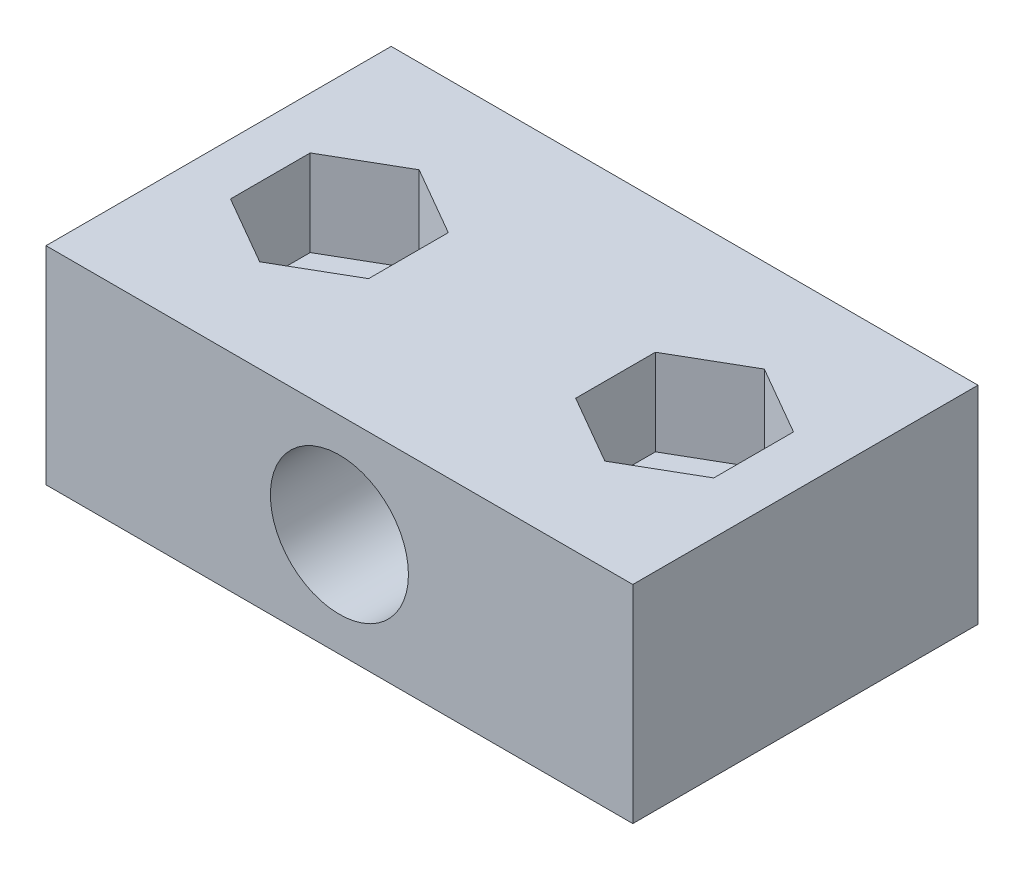
ISO-10303-21;
HEADER;
FILE_DESCRIPTION(('STEP AP214'),'2;1');
FILE_NAME('part.step','',(''),(''),'','','');
FILE_SCHEMA(('AUTOMOTIVE_DESIGN { 1 0 10303 214 1 1 1 1 }'));
ENDSEC;
DATA;
#1=APPLICATION_CONTEXT('core data for automotive mechanical design processes');
#2=APPLICATION_PROTOCOL_DEFINITION('international standard','automotive_design',2000,#1);
#3=PRODUCT_CONTEXT('',#1,'mechanical');
#4=PRODUCT('Part','Part','',(#3));
#5=PRODUCT_RELATED_PRODUCT_CATEGORY('part','',(#4));
#6=PRODUCT_DEFINITION_FORMATION('','',#4);
#7=PRODUCT_DEFINITION_CONTEXT('part definition',#1,'design');
#8=PRODUCT_DEFINITION('design','',#6,#7);
#9=PRODUCT_DEFINITION_SHAPE('','',#8);
#10=(LENGTH_UNIT() NAMED_UNIT(*) SI_UNIT(.MILLI.,.METRE.));
#11=(NAMED_UNIT(*) PLANE_ANGLE_UNIT() SI_UNIT($,.RADIAN.));
#12=(NAMED_UNIT(*) SI_UNIT($,.STERADIAN.) SOLID_ANGLE_UNIT());
#13=UNCERTAINTY_MEASURE_WITH_UNIT(LENGTH_MEASURE(1.E-05),#10,'distance_accuracy_value','');
#14=(GEOMETRIC_REPRESENTATION_CONTEXT(3) GLOBAL_UNCERTAINTY_ASSIGNED_CONTEXT((#13)) GLOBAL_UNIT_ASSIGNED_CONTEXT((#10,
#11,#12)) REPRESENTATION_CONTEXT('',''));
#15=CARTESIAN_POINT('',(0.,0.,0.));
#16=DIRECTION('',(0.,0.,1.));
#17=DIRECTION('',(1.,0.,0.));
#18=AXIS2_PLACEMENT_3D('',#15,#16,#17);
#19=CARTESIAN_POINT('',(-10.,-6.00000000000001,10.));
#20=DIRECTION('',(0.,1.,0.));
#21=DIRECTION('',(-1.,0.,0.));
#22=AXIS2_PLACEMENT_3D('',#19,#20,#21);
#23=CYLINDRICAL_SURFACE('',#22,2.55);
#24=CARTESIAN_POINT('',(-10.,1.,10.));
#25=DIRECTION('',(0.,1.,0.));
#26=DIRECTION('',(0.,0.,1.));
#27=AXIS2_PLACEMENT_3D('',#24,#25,#26);
#28=CIRCLE('',#27,2.55);
#29=CARTESIAN_POINT('',(-10.,1.,12.55));
#30=VERTEX_POINT('',#29);
#31=EDGE_CURVE('E246',#30,#30,#28,.F.);
#32=ORIENTED_EDGE('',*,*,#31,.F.);
#33=EDGE_LOOP('',(#32));
#34=FACE_BOUND('',#33,.T.);
#35=CARTESIAN_POINT('',(-10.,-4.,10.));
#36=DIRECTION('',(0.,-1.,0.));
#37=DIRECTION('',(1.,0.,0.));
#38=AXIS2_PLACEMENT_3D('',#35,#36,#37);
#39=CIRCLE('',#38,2.55);
#40=CARTESIAN_POINT('',(-7.45,-4.,10.));
#41=VERTEX_POINT('',#40);
#42=EDGE_CURVE('E38',#41,#41,#39,.F.);
#43=ORIENTED_EDGE('',*,*,#42,.F.);
#44=EDGE_LOOP('',(#43));
#45=FACE_BOUND('',#44,.T.);
#46=ADVANCED_FACE('F34',(#34,#45),#23,.F.);
#47=CARTESIAN_POINT('',(10.,-6.00000000000001,10.));
#48=DIRECTION('',(0.,1.,0.));
#49=DIRECTION('',(-1.,0.,0.));
#50=AXIS2_PLACEMENT_3D('',#47,#48,#49);
#51=CYLINDRICAL_SURFACE('',#50,2.55);
#52=CARTESIAN_POINT('',(10.,1.,10.));
#53=DIRECTION('',(0.,-1.,0.));
#54=DIRECTION('',(1.,0.,0.));
#55=AXIS2_PLACEMENT_3D('',#52,#53,#54);
#56=CIRCLE('',#55,2.55);
#57=CARTESIAN_POINT('',(12.55,1.00000000000001,10.));
#58=VERTEX_POINT('',#57);
#59=EDGE_CURVE('E201',#58,#58,#56,.F.);
#60=ORIENTED_EDGE('',*,*,#59,.T.);
#61=EDGE_LOOP('',(#60));
#62=FACE_BOUND('',#61,.T.);
#63=CARTESIAN_POINT('',(10.,-4.,10.));
#64=DIRECTION('',(0.,-1.,0.));
#65=DIRECTION('',(1.,0.,0.));
#66=AXIS2_PLACEMENT_3D('',#63,#64,#65);
#67=CIRCLE('',#66,2.55);
#68=CARTESIAN_POINT('',(12.55,-4.,10.));
#69=VERTEX_POINT('',#68);
#70=EDGE_CURVE('E189',#69,#69,#67,.F.);
#71=ORIENTED_EDGE('',*,*,#70,.F.);
#72=EDGE_LOOP('',(#71));
#73=FACE_BOUND('',#72,.T.);
#74=ADVANCED_FACE('F313',(#62,#73),#51,.F.);
#75=CARTESIAN_POINT('',(-17.,-6.,20.));
#76=DIRECTION('',(1.,0.,0.));
#77=DIRECTION('',(0.,0.,-1.));
#78=AXIS2_PLACEMENT_3D('',#75,#76,#77);
#79=PLANE('',#78);
#80=DIRECTION('',(0.,-1.,0.));
#81=VECTOR('',#80,1.);
#82=CARTESIAN_POINT('',(-17.,-6.,0.));
#83=LINE('',#82,#81);
#84=CARTESIAN_POINT('',(-17.,6.,0.));
#85=VERTEX_POINT('',#84);
#86=CARTESIAN_POINT('',(-17.,-6.,0.));
#87=VERTEX_POINT('',#86);
#88=EDGE_CURVE('E259',#85,#87,#83,.T.);
#89=ORIENTED_EDGE('',*,*,#88,.T.);
#90=DIRECTION('',(0.,0.,-1.));
#91=VECTOR('',#90,1.);
#92=CARTESIAN_POINT('',(-17.,-6.,20.));
#93=LINE('',#92,#91);
#94=CARTESIAN_POINT('',(-17.,-6.,20.));
#95=VERTEX_POINT('',#94);
#96=EDGE_CURVE('E11',#95,#87,#93,.T.);
#97=ORIENTED_EDGE('',*,*,#96,.F.);
#98=DIRECTION('',(0.,-1.,0.));
#99=VECTOR('',#98,1.);
#100=CARTESIAN_POINT('',(-17.,-6.,20.));
#101=LINE('',#100,#99);
#102=CARTESIAN_POINT('',(-17.,6.,20.));
#103=VERTEX_POINT('',#102);
#104=EDGE_CURVE('E263',#103,#95,#101,.T.);
#105=ORIENTED_EDGE('',*,*,#104,.F.);
#106=DIRECTION('',(0.,0.,-1.));
#107=VECTOR('',#106,1.);
#108=CARTESIAN_POINT('',(-17.,6.,20.));
#109=LINE('',#108,#107);
#110=EDGE_CURVE('E273',#103,#85,#109,.T.);
#111=ORIENTED_EDGE('',*,*,#110,.T.);
#112=EDGE_LOOP('',(#89,#97,#105,#111));
#113=FACE_BOUND('',#112,.T.);
#114=ADVANCED_FACE('F36',(#113),#79,.F.);
#115=CARTESIAN_POINT('',(17.,-6.,20.));
#116=DIRECTION('',(0.,1.,0.));
#117=DIRECTION('',(-1.,0.,0.));
#118=AXIS2_PLACEMENT_3D('',#115,#116,#117);
#119=PLANE('',#118);
#120=CARTESIAN_POINT('',(-10.,-6.,10.));
#121=DIRECTION('',(0.,-1.,0.));
#122=DIRECTION('',(1.,0.,0.));
#123=AXIS2_PLACEMENT_3D('',#120,#121,#122);
#124=CIRCLE('',#123,4.5);
#125=CARTESIAN_POINT('',(-5.5,-6.,10.));
#126=VERTEX_POINT('',#125);
#127=EDGE_CURVE('E300',#126,#126,#124,.T.);
#128=ORIENTED_EDGE('',*,*,#127,.F.);
#129=EDGE_LOOP('',(#128));
#130=FACE_BOUND('',#129,.T.);
#131=CARTESIAN_POINT('',(10.,-6.,10.));
#132=DIRECTION('',(0.,-1.,0.));
#133=DIRECTION('',(1.,0.,0.));
#134=AXIS2_PLACEMENT_3D('',#131,#132,#133);
#135=CIRCLE('',#134,4.5);
#136=CARTESIAN_POINT('',(14.5,-6.,10.));
#137=VERTEX_POINT('',#136);
#138=EDGE_CURVE('E177',#137,#137,#135,.T.);
#139=ORIENTED_EDGE('',*,*,#138,.F.);
#140=EDGE_LOOP('',(#139));
#141=FACE_BOUND('',#140,.T.);
#142=DIRECTION('',(1.,0.,0.));
#143=VECTOR('',#142,1.);
#144=CARTESIAN_POINT('',(17.,-6.,0.));
#145=LINE('',#144,#143);
#146=CARTESIAN_POINT('',(17.,-6.,0.));
#147=VERTEX_POINT('',#146);
#148=EDGE_CURVE('E276',#87,#147,#145,.T.);
#149=ORIENTED_EDGE('',*,*,#148,.T.);
#150=DIRECTION('',(0.,0.,-1.));
#151=VECTOR('',#150,1.);
#152=CARTESIAN_POINT('',(17.,-6.,20.));
#153=LINE('',#152,#151);
#154=CARTESIAN_POINT('',(17.,-6.,20.));
#155=VERTEX_POINT('',#154);
#156=EDGE_CURVE('E43',#155,#147,#153,.T.);
#157=ORIENTED_EDGE('',*,*,#156,.F.);
#158=DIRECTION('',(1.,0.,0.));
#159=VECTOR('',#158,1.);
#160=CARTESIAN_POINT('',(17.,-6.,20.));
#161=LINE('',#160,#159);
#162=EDGE_CURVE('E266',#95,#155,#161,.T.);
#163=ORIENTED_EDGE('',*,*,#162,.F.);
#164=ORIENTED_EDGE('',*,*,#96,.T.);
#165=EDGE_LOOP('',(#149,#157,#163,#164));
#166=FACE_BOUND('',#165,.T.);
#167=ADVANCED_FACE('F343',(#130,#141,#166),#119,.F.);
#168=CARTESIAN_POINT('',(17.,-6.,20.));
#169=DIRECTION('',(-1.,0.,0.));
#170=DIRECTION('',(0.,0.,1.));
#171=AXIS2_PLACEMENT_3D('',#168,#169,#170);
#172=PLANE('',#171);
#173=DIRECTION('',(0.,1.,0.));
#174=VECTOR('',#173,1.);
#175=CARTESIAN_POINT('',(17.,-6.,0.));
#176=LINE('',#175,#174);
#177=CARTESIAN_POINT('',(17.,6.,0.));
#178=VERTEX_POINT('',#177);
#179=EDGE_CURVE('E278',#147,#178,#176,.T.);
#180=ORIENTED_EDGE('',*,*,#179,.T.);
#181=DIRECTION('',(0.,0.,-1.));
#182=VECTOR('',#181,1.);
#183=CARTESIAN_POINT('',(17.,6.,20.));
#184=LINE('',#183,#182);
#185=CARTESIAN_POINT('',(17.,6.,20.));
#186=VERTEX_POINT('',#185);
#187=EDGE_CURVE('E283',#186,#178,#184,.T.);
#188=ORIENTED_EDGE('',*,*,#187,.F.);
#189=DIRECTION('',(0.,1.,0.));
#190=VECTOR('',#189,1.);
#191=CARTESIAN_POINT('',(17.,-6.,20.));
#192=LINE('',#191,#190);
#193=EDGE_CURVE('E269',#155,#186,#192,.T.);
#194=ORIENTED_EDGE('',*,*,#193,.F.);
#195=ORIENTED_EDGE('',*,*,#156,.T.);
#196=EDGE_LOOP('',(#180,#188,#194,#195));
#197=FACE_BOUND('',#196,.T.);
#198=ADVANCED_FACE('F340',(#197),#172,.F.);
#199=CARTESIAN_POINT('',(17.,6.,20.));
#200=DIRECTION('',(0.,-1.,0.));
#201=DIRECTION('',(1.,0.,0.));
#202=AXIS2_PLACEMENT_3D('',#199,#200,#201);
#203=PLANE('',#202);
#204=DIRECTION('',(0.866025403784439,0.,0.5));
#205=VECTOR('',#204,1.);
#206=CARTESIAN_POINT('',(9.99999999999999,6.,14.618802153517));
#207=LINE('',#206,#205);
#208=CARTESIAN_POINT('',(6.,6.,12.3094010767585));
#209=VERTEX_POINT('',#208);
#210=CARTESIAN_POINT('',(9.99999999999999,6.,14.618802153517));
#211=VERTEX_POINT('',#210);
#212=EDGE_CURVE('E188',#209,#211,#207,.T.);
#213=ORIENTED_EDGE('',*,*,#212,.F.);
#214=DIRECTION('',(0.,0.,1.));
#215=VECTOR('',#214,1.);
#216=CARTESIAN_POINT('',(6.,6.,12.3094010767585));
#217=LINE('',#216,#215);
#218=CARTESIAN_POINT('',(6.,6.,7.69059892324149));
#219=VERTEX_POINT('',#218);
#220=EDGE_CURVE('E51',#219,#209,#217,.T.);
#221=ORIENTED_EDGE('',*,*,#220,.F.);
#222=DIRECTION('',(-0.866025403784439,0.,0.5));
#223=VECTOR('',#222,1.);
#224=CARTESIAN_POINT('',(6.,6.,7.69059892324149));
#225=LINE('',#224,#223);
#226=CARTESIAN_POINT('',(10.,6.,5.38119784648299));
#227=VERTEX_POINT('',#226);
#228=EDGE_CURVE('E171',#227,#219,#225,.T.);
#229=ORIENTED_EDGE('',*,*,#228,.F.);
#230=DIRECTION('',(-0.866025403784439,0.,-0.499999999999999));
#231=VECTOR('',#230,1.);
#232=CARTESIAN_POINT('',(10.,6.,5.38119784648299));
#233=LINE('',#232,#231);
#234=CARTESIAN_POINT('',(14.,6.,7.69059892324149));
#235=VERTEX_POINT('',#234);
#236=EDGE_CURVE('E174',#235,#227,#233,.T.);
#237=ORIENTED_EDGE('',*,*,#236,.F.);
#238=DIRECTION('',(0.,0.,-1.));
#239=VECTOR('',#238,1.);
#240=CARTESIAN_POINT('',(14.,6.,7.69059892324149));
#241=LINE('',#240,#239);
#242=CARTESIAN_POINT('',(14.,6.,12.3094010767585));
#243=VERTEX_POINT('',#242);
#244=EDGE_CURVE('E194',#243,#235,#241,.T.);
#245=ORIENTED_EDGE('',*,*,#244,.F.);
#246=DIRECTION('',(0.866025403784438,0.,-0.5));
#247=VECTOR('',#246,1.);
#248=CARTESIAN_POINT('',(14.,6.,12.3094010767585));
#249=LINE('',#248,#247);
#250=EDGE_CURVE('E191',#211,#243,#249,.T.);
#251=ORIENTED_EDGE('',*,*,#250,.F.);
#252=EDGE_LOOP('',(#213,#221,#229,#237,#245,#251));
#253=FACE_BOUND('',#252,.T.);
#254=DIRECTION('',(-0.866025403784439,0.,0.499999999999999));
#255=VECTOR('',#254,1.);
#256=CARTESIAN_POINT('',(-10.,6.,5.38119784648299));
#257=LINE('',#256,#255);
#258=CARTESIAN_POINT('',(-10.,6.,5.381197846483));
#259=VERTEX_POINT('',#258);
#260=CARTESIAN_POINT('',(-14.,6.,7.69059892324149));
#261=VERTEX_POINT('',#260);
#262=EDGE_CURVE('E230',#259,#261,#257,.T.);
#263=ORIENTED_EDGE('',*,*,#262,.F.);
#264=DIRECTION('',(-0.866025403784439,0.,-0.5));
#265=VECTOR('',#264,1.);
#266=CARTESIAN_POINT('',(-6.,6.,7.6905989232415));
#267=LINE('',#266,#265);
#268=CARTESIAN_POINT('',(-6.,6.,7.6905989232415));
#269=VERTEX_POINT('',#268);
#270=EDGE_CURVE('E59',#269,#259,#267,.T.);
#271=ORIENTED_EDGE('',*,*,#270,.F.);
#272=DIRECTION('',(0.,0.,-1.));
#273=VECTOR('',#272,1.);
#274=CARTESIAN_POINT('',(-6.,6.,12.3094010767585));
#275=LINE('',#274,#273);
#276=CARTESIAN_POINT('',(-6.,6.,12.3094010767585));
#277=VERTEX_POINT('',#276);
#278=EDGE_CURVE('E213',#277,#269,#275,.T.);
#279=ORIENTED_EDGE('',*,*,#278,.F.);
#280=DIRECTION('',(0.866025403784439,0.,-0.5));
#281=VECTOR('',#280,1.);
#282=CARTESIAN_POINT('',(-10.,6.,14.618802153517));
#283=LINE('',#282,#281);
#284=CARTESIAN_POINT('',(-10.,6.,14.618802153517));
#285=VERTEX_POINT('',#284);
#286=EDGE_CURVE('E239',#285,#277,#283,.T.);
#287=ORIENTED_EDGE('',*,*,#286,.F.);
#288=DIRECTION('',(0.866025403784438,0.,0.5));
#289=VECTOR('',#288,1.);
#290=CARTESIAN_POINT('',(-14.,6.,12.3094010767585));
#291=LINE('',#290,#289);
#292=CARTESIAN_POINT('',(-14.,6.,12.3094010767585));
#293=VERTEX_POINT('',#292);
#294=EDGE_CURVE('E236',#293,#285,#291,.T.);
#295=ORIENTED_EDGE('',*,*,#294,.F.);
#296=DIRECTION('',(0.,0.,1.));
#297=VECTOR('',#296,1.);
#298=CARTESIAN_POINT('',(-14.,6.,7.69059892324149));
#299=LINE('',#298,#297);
#300=EDGE_CURVE('E233',#261,#293,#299,.T.);
#301=ORIENTED_EDGE('',*,*,#300,.F.);
#302=EDGE_LOOP('',(#263,#271,#279,#287,#295,#301));
#303=FACE_BOUND('',#302,.T.);
#304=DIRECTION('',(-1.,0.,0.));
#305=VECTOR('',#304,1.);
#306=CARTESIAN_POINT('',(17.,6.,0.));
#307=LINE('',#306,#305);
#308=EDGE_CURVE('E267',#178,#85,#307,.T.);
#309=ORIENTED_EDGE('',*,*,#308,.T.);
#310=ORIENTED_EDGE('',*,*,#110,.F.);
#311=DIRECTION('',(-1.,0.,0.));
#312=VECTOR('',#311,1.);
#313=CARTESIAN_POINT('',(17.,6.,20.));
#314=LINE('',#313,#312);
#315=EDGE_CURVE('E271',#186,#103,#314,.T.);
#316=ORIENTED_EDGE('',*,*,#315,.F.);
#317=ORIENTED_EDGE('',*,*,#187,.T.);
#318=EDGE_LOOP('',(#309,#310,#316,#317));
#319=FACE_BOUND('',#318,.T.);
#320=ADVANCED_FACE('F333',(#253,#303,#319),#203,.F.);
#321=CARTESIAN_POINT('',(0.,0.,20.));
#322=DIRECTION('',(0.,0.,1.));
#323=DIRECTION('',(1.,0.,0.));
#324=AXIS2_PLACEMENT_3D('',#321,#322,#323);
#325=PLANE('',#324);
#326=CARTESIAN_POINT('',(0.,0.,20.));
#327=DIRECTION('',(0.,0.,1.));
#328=DIRECTION('',(1.,0.,0.));
#329=AXIS2_PLACEMENT_3D('',#326,#327,#328);
#330=CIRCLE('',#329,4.);
#331=CARTESIAN_POINT('',(4.,0.,20.));
#332=VERTEX_POINT('',#331);
#333=EDGE_CURVE('E260',#332,#332,#330,.T.);
#334=ORIENTED_EDGE('',*,*,#333,.F.);
#335=EDGE_LOOP('',(#334));
#336=FACE_BOUND('',#335,.T.);
#337=ORIENTED_EDGE('',*,*,#104,.T.);
#338=ORIENTED_EDGE('',*,*,#162,.T.);
#339=ORIENTED_EDGE('',*,*,#193,.T.);
#340=ORIENTED_EDGE('',*,*,#315,.T.);
#341=EDGE_LOOP('',(#337,#338,#339,#340));
#342=FACE_BOUND('',#341,.T.);
#343=ADVANCED_FACE('F330',(#336,#342),#325,.T.);
#344=CARTESIAN_POINT('',(0.,0.,0.));
#345=DIRECTION('',(0.,0.,1.));
#346=DIRECTION('',(1.,0.,0.));
#347=AXIS2_PLACEMENT_3D('',#344,#345,#346);
#348=PLANE('',#347);
#349=CARTESIAN_POINT('',(0.,0.,0.));
#350=DIRECTION('',(0.,0.,1.));
#351=DIRECTION('',(1.,0.,0.));
#352=AXIS2_PLACEMENT_3D('',#349,#350,#351);
#353=CIRCLE('',#352,4.);
#354=CARTESIAN_POINT('',(4.,0.,0.));
#355=VERTEX_POINT('',#354);
#356=EDGE_CURVE('E256',#355,#355,#353,.T.);
#357=ORIENTED_EDGE('',*,*,#356,.T.);
#358=EDGE_LOOP('',(#357));
#359=FACE_BOUND('',#358,.T.);
#360=ORIENTED_EDGE('',*,*,#88,.F.);
#361=ORIENTED_EDGE('',*,*,#308,.F.);
#362=ORIENTED_EDGE('',*,*,#179,.F.);
#363=ORIENTED_EDGE('',*,*,#148,.F.);
#364=EDGE_LOOP('',(#360,#361,#362,#363));
#365=FACE_BOUND('',#364,.T.);
#366=ADVANCED_FACE('F328',(#359,#365),#348,.F.);
#367=CARTESIAN_POINT('',(0.,0.,0.));
#368=DIRECTION('',(0.,0.,1.));
#369=DIRECTION('',(1.,0.,0.));
#370=AXIS2_PLACEMENT_3D('',#367,#368,#369);
#371=CYLINDRICAL_SURFACE('',#370,4.);
#372=ORIENTED_EDGE('',*,*,#356,.F.);
#373=EDGE_LOOP('',(#372));
#374=FACE_BOUND('',#373,.T.);
#375=ORIENTED_EDGE('',*,*,#333,.T.);
#376=EDGE_LOOP('',(#375));
#377=FACE_BOUND('',#376,.T.);
#378=ADVANCED_FACE('F324',(#374,#377),#371,.F.);
#379=CARTESIAN_POINT('',(0.,1.,0.));
#380=DIRECTION('',(0.,1.,0.));
#381=DIRECTION('',(0.,0.,1.));
#382=AXIS2_PLACEMENT_3D('',#379,#380,#381);
#383=PLANE('',#382);
#384=DIRECTION('',(-0.866025403784439,0.,-0.5));
#385=VECTOR('',#384,1.);
#386=CARTESIAN_POINT('',(-6.,1.,7.6905989232415));
#387=LINE('',#386,#385);
#388=CARTESIAN_POINT('',(-6.,1.,7.6905989232415));
#389=VERTEX_POINT('',#388);
#390=CARTESIAN_POINT('',(-10.,1.,5.38119784648299));
#391=VERTEX_POINT('',#390);
#392=EDGE_CURVE('E209',#389,#391,#387,.T.);
#393=ORIENTED_EDGE('',*,*,#392,.T.);
#394=DIRECTION('',(-0.866025403784439,0.,0.499999999999999));
#395=VECTOR('',#394,1.);
#396=CARTESIAN_POINT('',(-10.,1.,5.38119784648299));
#397=LINE('',#396,#395);
#398=CARTESIAN_POINT('',(-14.,1.,7.69059892324149));
#399=VERTEX_POINT('',#398);
#400=EDGE_CURVE('E212',#391,#399,#397,.T.);
#401=ORIENTED_EDGE('',*,*,#400,.T.);
#402=DIRECTION('',(0.,0.,1.));
#403=VECTOR('',#402,1.);
#404=CARTESIAN_POINT('',(-14.,1.,7.69059892324149));
#405=LINE('',#404,#403);
#406=CARTESIAN_POINT('',(-14.,1.,12.3094010767585));
#407=VERTEX_POINT('',#406);
#408=EDGE_CURVE('E216',#399,#407,#405,.T.);
#409=ORIENTED_EDGE('',*,*,#408,.T.);
#410=DIRECTION('',(0.866025403784438,0.,0.5));
#411=VECTOR('',#410,1.);
#412=CARTESIAN_POINT('',(-14.,1.,12.3094010767585));
#413=LINE('',#412,#411);
#414=CARTESIAN_POINT('',(-10.,1.,14.618802153517));
#415=VERTEX_POINT('',#414);
#416=EDGE_CURVE('E219',#407,#415,#413,.T.);
#417=ORIENTED_EDGE('',*,*,#416,.T.);
#418=DIRECTION('',(0.866025403784439,0.,-0.5));
#419=VECTOR('',#418,1.);
#420=CARTESIAN_POINT('',(-10.,1.,14.618802153517));
#421=LINE('',#420,#419);
#422=CARTESIAN_POINT('',(-6.,1.,12.3094010767585));
#423=VERTEX_POINT('',#422);
#424=EDGE_CURVE('E222',#415,#423,#421,.T.);
#425=ORIENTED_EDGE('',*,*,#424,.T.);
#426=DIRECTION('',(0.,0.,-1.));
#427=VECTOR('',#426,1.);
#428=CARTESIAN_POINT('',(-6.,1.,12.3094010767585));
#429=LINE('',#428,#427);
#430=EDGE_CURVE('E225',#423,#389,#429,.T.);
#431=ORIENTED_EDGE('',*,*,#430,.T.);
#432=EDGE_LOOP('',(#393,#401,#409,#417,#425,#431));
#433=FACE_BOUND('',#432,.T.);
#434=ORIENTED_EDGE('',*,*,#31,.T.);
#435=EDGE_LOOP('',(#434));
#436=FACE_BOUND('',#435,.T.);
#437=ADVANCED_FACE('F327',(#433,#436),#383,.T.);
#438=CARTESIAN_POINT('',(-6.,1.,7.6905989232415));
#439=DIRECTION('',(0.5,0.,-0.866025403784439));
#440=DIRECTION('',(-0.866025403784439,0.,-0.5));
#441=AXIS2_PLACEMENT_3D('',#438,#439,#440);
#442=PLANE('',#441);
#443=ORIENTED_EDGE('',*,*,#270,.T.);
#444=DIRECTION('',(0.,1.,0.));
#445=VECTOR('',#444,1.);
#446=CARTESIAN_POINT('',(-10.,1.,5.38119784648299));
#447=LINE('',#446,#445);
#448=EDGE_CURVE('E228',#391,#259,#447,.T.);
#449=ORIENTED_EDGE('',*,*,#448,.F.);
#450=ORIENTED_EDGE('',*,*,#392,.F.);
#451=DIRECTION('',(0.,1.,0.));
#452=VECTOR('',#451,1.);
#453=CARTESIAN_POINT('',(-6.,1.,7.6905989232415));
#454=LINE('',#453,#452);
#455=EDGE_CURVE('E244',#389,#269,#454,.T.);
#456=ORIENTED_EDGE('',*,*,#455,.T.);
#457=EDGE_LOOP('',(#443,#449,#450,#456));
#458=FACE_BOUND('',#457,.T.);
#459=ADVANCED_FACE('F408',(#458),#442,.F.);
#460=CARTESIAN_POINT('',(-6.,1.,12.3094010767585));
#461=DIRECTION('',(1.,0.,0.));
#462=DIRECTION('',(0.,1.,0.));
#463=AXIS2_PLACEMENT_3D('',#460,#461,#462);
#464=PLANE('',#463);
#465=ORIENTED_EDGE('',*,*,#278,.T.);
#466=ORIENTED_EDGE('',*,*,#455,.F.);
#467=ORIENTED_EDGE('',*,*,#430,.F.);
#468=DIRECTION('',(0.,1.,0.));
#469=VECTOR('',#468,1.);
#470=CARTESIAN_POINT('',(-6.,1.,12.3094010767585));
#471=LINE('',#470,#469);
#472=EDGE_CURVE('E247',#423,#277,#471,.T.);
#473=ORIENTED_EDGE('',*,*,#472,.T.);
#474=EDGE_LOOP('',(#465,#466,#467,#473));
#475=FACE_BOUND('',#474,.T.);
#476=ADVANCED_FACE('F410',(#475),#464,.F.);
#477=CARTESIAN_POINT('',(-10.,1.,14.618802153517));
#478=DIRECTION('',(0.5,0.,0.866025403784439));
#479=DIRECTION('',(0.866025403784439,0.,-0.5));
#480=AXIS2_PLACEMENT_3D('',#477,#478,#479);
#481=PLANE('',#480);
#482=ORIENTED_EDGE('',*,*,#286,.T.);
#483=ORIENTED_EDGE('',*,*,#472,.F.);
#484=ORIENTED_EDGE('',*,*,#424,.F.);
#485=DIRECTION('',(0.,1.,0.));
#486=VECTOR('',#485,1.);
#487=CARTESIAN_POINT('',(-10.,1.,14.618802153517));
#488=LINE('',#487,#486);
#489=EDGE_CURVE('E249',#415,#285,#488,.T.);
#490=ORIENTED_EDGE('',*,*,#489,.T.);
#491=EDGE_LOOP('',(#482,#483,#484,#490));
#492=FACE_BOUND('',#491,.T.);
#493=ADVANCED_FACE('F413',(#492),#481,.F.);
#494=CARTESIAN_POINT('',(-14.,1.,12.3094010767585));
#495=DIRECTION('',(-0.5,0.,0.866025403784439));
#496=DIRECTION('',(0.866025403784439,0.,0.5));
#497=AXIS2_PLACEMENT_3D('',#494,#495,#496);
#498=PLANE('',#497);
#499=ORIENTED_EDGE('',*,*,#294,.T.);
#500=ORIENTED_EDGE('',*,*,#489,.F.);
#501=ORIENTED_EDGE('',*,*,#416,.F.);
#502=DIRECTION('',(0.,1.,0.));
#503=VECTOR('',#502,1.);
#504=CARTESIAN_POINT('',(-14.,1.,12.3094010767585));
#505=LINE('',#504,#503);
#506=EDGE_CURVE('E251',#407,#293,#505,.T.);
#507=ORIENTED_EDGE('',*,*,#506,.T.);
#508=EDGE_LOOP('',(#499,#500,#501,#507));
#509=FACE_BOUND('',#508,.T.);
#510=ADVANCED_FACE('F417',(#509),#498,.F.);
#511=CARTESIAN_POINT('',(-14.,1.,7.69059892324149));
#512=DIRECTION('',(-1.,0.,0.));
#513=DIRECTION('',(0.,-1.,0.));
#514=AXIS2_PLACEMENT_3D('',#511,#512,#513);
#515=PLANE('',#514);
#516=ORIENTED_EDGE('',*,*,#300,.T.);
#517=ORIENTED_EDGE('',*,*,#506,.F.);
#518=ORIENTED_EDGE('',*,*,#408,.F.);
#519=DIRECTION('',(0.,1.,0.));
#520=VECTOR('',#519,1.);
#521=CARTESIAN_POINT('',(-14.,1.,7.69059892324149));
#522=LINE('',#521,#520);
#523=EDGE_CURVE('E253',#399,#261,#522,.T.);
#524=ORIENTED_EDGE('',*,*,#523,.T.);
#525=EDGE_LOOP('',(#516,#517,#518,#524));
#526=FACE_BOUND('',#525,.T.);
#527=ADVANCED_FACE('F421',(#526),#515,.F.);
#528=CARTESIAN_POINT('',(-10.,1.,5.38119784648299));
#529=DIRECTION('',(-0.5,0.,-0.866025403784439));
#530=DIRECTION('',(-0.866025403784439,0.,0.5));
#531=AXIS2_PLACEMENT_3D('',#528,#529,#530);
#532=PLANE('',#531);
#533=ORIENTED_EDGE('',*,*,#262,.T.);
#534=ORIENTED_EDGE('',*,*,#523,.F.);
#535=ORIENTED_EDGE('',*,*,#400,.F.);
#536=ORIENTED_EDGE('',*,*,#448,.T.);
#537=EDGE_LOOP('',(#533,#534,#535,#536));
#538=FACE_BOUND('',#537,.T.);
#539=ADVANCED_FACE('F385',(#538),#532,.F.);
#540=CARTESIAN_POINT('',(0.,1.,0.));
#541=DIRECTION('',(0.,-1.,0.));
#542=DIRECTION('',(1.,0.,0.));
#543=AXIS2_PLACEMENT_3D('',#540,#541,#542);
#544=PLANE('',#543);
#545=DIRECTION('',(0.,0.,1.));
#546=VECTOR('',#545,1.);
#547=CARTESIAN_POINT('',(6.,1.,12.3094010767585));
#548=LINE('',#547,#546);
#549=CARTESIAN_POINT('',(6.,1.,7.69059892324149));
#550=VERTEX_POINT('',#549);
#551=CARTESIAN_POINT('',(6.,1.,12.3094010767585));
#552=VERTEX_POINT('',#551);
#553=EDGE_CURVE('E151',#550,#552,#548,.T.);
#554=ORIENTED_EDGE('',*,*,#553,.T.);
#555=DIRECTION('',(0.866025403784439,0.,0.5));
#556=VECTOR('',#555,1.);
#557=CARTESIAN_POINT('',(9.99999999999999,1.,14.618802153517));
#558=LINE('',#557,#556);
#559=CARTESIAN_POINT('',(9.99999999999999,1.,14.618802153517));
#560=VERTEX_POINT('',#559);
#561=EDGE_CURVE('E160',#552,#560,#558,.T.);
#562=ORIENTED_EDGE('',*,*,#561,.T.);
#563=DIRECTION('',(0.866025403784438,0.,-0.5));
#564=VECTOR('',#563,1.);
#565=CARTESIAN_POINT('',(14.,1.,12.3094010767585));
#566=LINE('',#565,#564);
#567=CARTESIAN_POINT('',(14.,1.,12.3094010767585));
#568=VERTEX_POINT('',#567);
#569=EDGE_CURVE('E165',#560,#568,#566,.T.);
#570=ORIENTED_EDGE('',*,*,#569,.T.);
#571=DIRECTION('',(0.,0.,-1.));
#572=VECTOR('',#571,1.);
#573=CARTESIAN_POINT('',(14.,1.,7.69059892324149));
#574=LINE('',#573,#572);
#575=CARTESIAN_POINT('',(14.,1.,7.69059892324149));
#576=VERTEX_POINT('',#575);
#577=EDGE_CURVE('E181',#568,#576,#574,.T.);
#578=ORIENTED_EDGE('',*,*,#577,.T.);
#579=DIRECTION('',(-0.866025403784439,0.,-0.499999999999999));
#580=VECTOR('',#579,1.);
#581=CARTESIAN_POINT('',(10.,1.,5.38119784648299));
#582=LINE('',#581,#580);
#583=CARTESIAN_POINT('',(10.,1.,5.38119784648299));
#584=VERTEX_POINT('',#583);
#585=EDGE_CURVE('E184',#576,#584,#582,.T.);
#586=ORIENTED_EDGE('',*,*,#585,.T.);
#587=DIRECTION('',(-0.866025403784439,0.,0.5));
#588=VECTOR('',#587,1.);
#589=CARTESIAN_POINT('',(6.,1.,7.69059892324149));
#590=LINE('',#589,#588);
#591=EDGE_CURVE('E157',#584,#550,#590,.T.);
#592=ORIENTED_EDGE('',*,*,#591,.T.);
#593=EDGE_LOOP('',(#554,#562,#570,#578,#586,#592));
#594=FACE_BOUND('',#593,.T.);
#595=ORIENTED_EDGE('',*,*,#59,.F.);
#596=EDGE_LOOP('',(#595));
#597=FACE_BOUND('',#596,.T.);
#598=ADVANCED_FACE('F167',(#594,#597),#544,.F.);
#599=CARTESIAN_POINT('',(6.,1.,12.3094010767585));
#600=DIRECTION('',(-1.,0.,0.));
#601=DIRECTION('',(0.,-1.,0.));
#602=AXIS2_PLACEMENT_3D('',#599,#600,#601);
#603=PLANE('',#602);
#604=ORIENTED_EDGE('',*,*,#220,.T.);
#605=DIRECTION('',(0.,1.,0.));
#606=VECTOR('',#605,1.);
#607=CARTESIAN_POINT('',(6.,1.,12.3094010767585));
#608=LINE('',#607,#606);
#609=EDGE_CURVE('E147',#552,#209,#608,.T.);
#610=ORIENTED_EDGE('',*,*,#609,.F.);
#611=ORIENTED_EDGE('',*,*,#553,.F.);
#612=DIRECTION('',(0.,1.,0.));
#613=VECTOR('',#612,1.);
#614=CARTESIAN_POINT('',(6.,1.,7.69059892324149));
#615=LINE('',#614,#613);
#616=EDGE_CURVE('E199',#550,#219,#615,.T.);
#617=ORIENTED_EDGE('',*,*,#616,.T.);
#618=EDGE_LOOP('',(#604,#610,#611,#617));
#619=FACE_BOUND('',#618,.T.);
#620=ADVANCED_FACE('F149',(#619),#603,.F.);
#621=CARTESIAN_POINT('',(6.,1.,7.69059892324149));
#622=DIRECTION('',(-0.5,0.,-0.866025403784439));
#623=DIRECTION('',(-0.866025403784439,0.,0.5));
#624=AXIS2_PLACEMENT_3D('',#621,#622,#623);
#625=PLANE('',#624);
#626=ORIENTED_EDGE('',*,*,#228,.T.);
#627=ORIENTED_EDGE('',*,*,#616,.F.);
#628=ORIENTED_EDGE('',*,*,#591,.F.);
#629=DIRECTION('',(0.,1.,0.));
#630=VECTOR('',#629,1.);
#631=CARTESIAN_POINT('',(10.,1.,5.38119784648299));
#632=LINE('',#631,#630);
#633=EDGE_CURVE('E202',#584,#227,#632,.T.);
#634=ORIENTED_EDGE('',*,*,#633,.T.);
#635=EDGE_LOOP('',(#626,#627,#628,#634));
#636=FACE_BOUND('',#635,.T.);
#637=ADVANCED_FACE('F386',(#636),#625,.F.);
#638=CARTESIAN_POINT('',(10.,1.,5.38119784648299));
#639=DIRECTION('',(0.5,0.,-0.866025403784439));
#640=DIRECTION('',(-0.866025403784439,0.,-0.5));
#641=AXIS2_PLACEMENT_3D('',#638,#639,#640);
#642=PLANE('',#641);
#643=ORIENTED_EDGE('',*,*,#236,.T.);
#644=ORIENTED_EDGE('',*,*,#633,.F.);
#645=ORIENTED_EDGE('',*,*,#585,.F.);
#646=DIRECTION('',(0.,1.,0.));
#647=VECTOR('',#646,1.);
#648=CARTESIAN_POINT('',(14.,1.,7.69059892324149));
#649=LINE('',#648,#647);
#650=EDGE_CURVE('E204',#576,#235,#649,.T.);
#651=ORIENTED_EDGE('',*,*,#650,.T.);
#652=EDGE_LOOP('',(#643,#644,#645,#651));
#653=FACE_BOUND('',#652,.T.);
#654=ADVANCED_FACE('F389',(#653),#642,.F.);
#655=CARTESIAN_POINT('',(14.,1.,7.69059892324149));
#656=DIRECTION('',(1.,0.,0.));
#657=DIRECTION('',(0.,1.,0.));
#658=AXIS2_PLACEMENT_3D('',#655,#656,#657);
#659=PLANE('',#658);
#660=ORIENTED_EDGE('',*,*,#244,.T.);
#661=ORIENTED_EDGE('',*,*,#650,.F.);
#662=ORIENTED_EDGE('',*,*,#577,.F.);
#663=DIRECTION('',(0.,1.,0.));
#664=VECTOR('',#663,1.);
#665=CARTESIAN_POINT('',(14.,1.,12.3094010767585));
#666=LINE('',#665,#664);
#667=EDGE_CURVE('E206',#568,#243,#666,.T.);
#668=ORIENTED_EDGE('',*,*,#667,.T.);
#669=EDGE_LOOP('',(#660,#661,#662,#668));
#670=FACE_BOUND('',#669,.T.);
#671=ADVANCED_FACE('F393',(#670),#659,.F.);
#672=CARTESIAN_POINT('',(14.,1.,12.3094010767585));
#673=DIRECTION('',(0.5,0.,0.866025403784439));
#674=DIRECTION('',(0.866025403784439,0.,-0.5));
#675=AXIS2_PLACEMENT_3D('',#672,#673,#674);
#676=PLANE('',#675);
#677=ORIENTED_EDGE('',*,*,#250,.T.);
#678=ORIENTED_EDGE('',*,*,#667,.F.);
#679=ORIENTED_EDGE('',*,*,#569,.F.);
#680=DIRECTION('',(0.,1.,0.));
#681=VECTOR('',#680,1.);
#682=CARTESIAN_POINT('',(9.99999999999999,1.,14.618802153517));
#683=LINE('',#682,#681);
#684=EDGE_CURVE('E156',#560,#211,#683,.T.);
#685=ORIENTED_EDGE('',*,*,#684,.T.);
#686=EDGE_LOOP('',(#677,#678,#679,#685));
#687=FACE_BOUND('',#686,.T.);
#688=ADVANCED_FACE('F397',(#687),#676,.F.);
#689=CARTESIAN_POINT('',(9.99999999999999,1.,14.618802153517));
#690=DIRECTION('',(-0.5,0.,0.866025403784439));
#691=DIRECTION('',(0.866025403784439,0.,0.5));
#692=AXIS2_PLACEMENT_3D('',#689,#690,#691);
#693=PLANE('',#692);
#694=ORIENTED_EDGE('',*,*,#212,.T.);
#695=ORIENTED_EDGE('',*,*,#684,.F.);
#696=ORIENTED_EDGE('',*,*,#561,.F.);
#697=ORIENTED_EDGE('',*,*,#609,.T.);
#698=EDGE_LOOP('',(#694,#695,#696,#697));
#699=FACE_BOUND('',#698,.T.);
#700=ADVANCED_FACE('F161',(#699),#693,.F.);
#701=CARTESIAN_POINT('',(10.,-4.,10.));
#702=DIRECTION('',(0.,-1.,0.));
#703=DIRECTION('',(1.,0.,0.));
#704=AXIS2_PLACEMENT_3D('',#701,#702,#703);
#705=PLANE('',#704);
#706=CARTESIAN_POINT('',(10.,-4.,10.));
#707=DIRECTION('',(0.,-1.,0.));
#708=DIRECTION('',(1.,0.,0.));
#709=AXIS2_PLACEMENT_3D('',#706,#707,#708);
#710=CIRCLE('',#709,4.5);
#711=CARTESIAN_POINT('',(14.5,-4.,10.));
#712=VERTEX_POINT('',#711);
#713=EDGE_CURVE('E292',#712,#712,#710,.T.);
#714=ORIENTED_EDGE('',*,*,#713,.T.);
#715=EDGE_LOOP('',(#714));
#716=FACE_BOUND('',#715,.T.);
#717=ORIENTED_EDGE('',*,*,#70,.T.);
#718=EDGE_LOOP('',(#717));
#719=FACE_BOUND('',#718,.T.);
#720=ADVANCED_FACE('F371',(#716,#719),#705,.T.);
#721=CARTESIAN_POINT('',(10.,-4.,10.));
#722=DIRECTION('',(0.,-1.,0.));
#723=DIRECTION('',(1.,0.,0.));
#724=AXIS2_PLACEMENT_3D('',#721,#722,#723);
#725=CYLINDRICAL_SURFACE('',#724,4.5);
#726=ORIENTED_EDGE('',*,*,#713,.F.);
#727=EDGE_LOOP('',(#726));
#728=FACE_BOUND('',#727,.T.);
#729=ORIENTED_EDGE('',*,*,#138,.T.);
#730=EDGE_LOOP('',(#729));
#731=FACE_BOUND('',#730,.T.);
#732=ADVANCED_FACE('F369',(#728,#731),#725,.F.);
#733=CARTESIAN_POINT('',(-10.,-4.,10.));
#734=DIRECTION('',(0.,-1.,0.));
#735=DIRECTION('',(1.,0.,0.));
#736=AXIS2_PLACEMENT_3D('',#733,#734,#735);
#737=PLANE('',#736);
#738=CARTESIAN_POINT('',(-10.,-4.,10.));
#739=DIRECTION('',(0.,-1.,0.));
#740=DIRECTION('',(1.,0.,0.));
#741=AXIS2_PLACEMENT_3D('',#738,#739,#740);
#742=CIRCLE('',#741,4.5);
#743=CARTESIAN_POINT('',(-5.5,-4.,10.));
#744=VERTEX_POINT('',#743);
#745=EDGE_CURVE('E303',#744,#744,#742,.T.);
#746=ORIENTED_EDGE('',*,*,#745,.T.);
#747=EDGE_LOOP('',(#746));
#748=FACE_BOUND('',#747,.T.);
#749=ORIENTED_EDGE('',*,*,#42,.T.);
#750=EDGE_LOOP('',(#749));
#751=FACE_BOUND('',#750,.T.);
#752=ADVANCED_FACE('F310',(#748,#751),#737,.T.);
#753=CARTESIAN_POINT('',(-10.,-4.,10.));
#754=DIRECTION('',(0.,-1.,0.));
#755=DIRECTION('',(1.,0.,0.));
#756=AXIS2_PLACEMENT_3D('',#753,#754,#755);
#757=CYLINDRICAL_SURFACE('',#756,4.5);
#758=ORIENTED_EDGE('',*,*,#745,.F.);
#759=EDGE_LOOP('',(#758));
#760=FACE_BOUND('',#759,.T.);
#761=ORIENTED_EDGE('',*,*,#127,.T.);
#762=EDGE_LOOP('',(#761));
#763=FACE_BOUND('',#762,.T.);
#764=ADVANCED_FACE('F378',(#760,#763),#757,.F.);
#765=CLOSED_SHELL('',(#46,#74,#114,#167,#198,#320,#343,#366,#378,#437,#459,#476,#493,#510,#527,
#539,#598,#620,#637,#654,#671,#688,#700,#720,#732,#752,#764));
#766=MANIFOLD_SOLID_BREP('B2',#765);
#767=ADVANCED_BREP_SHAPE_REPRESENTATION('',(#18,#766),#14);
#768=SHAPE_DEFINITION_REPRESENTATION(#9,#767);
ENDSEC;
END-ISO-10303-21;
